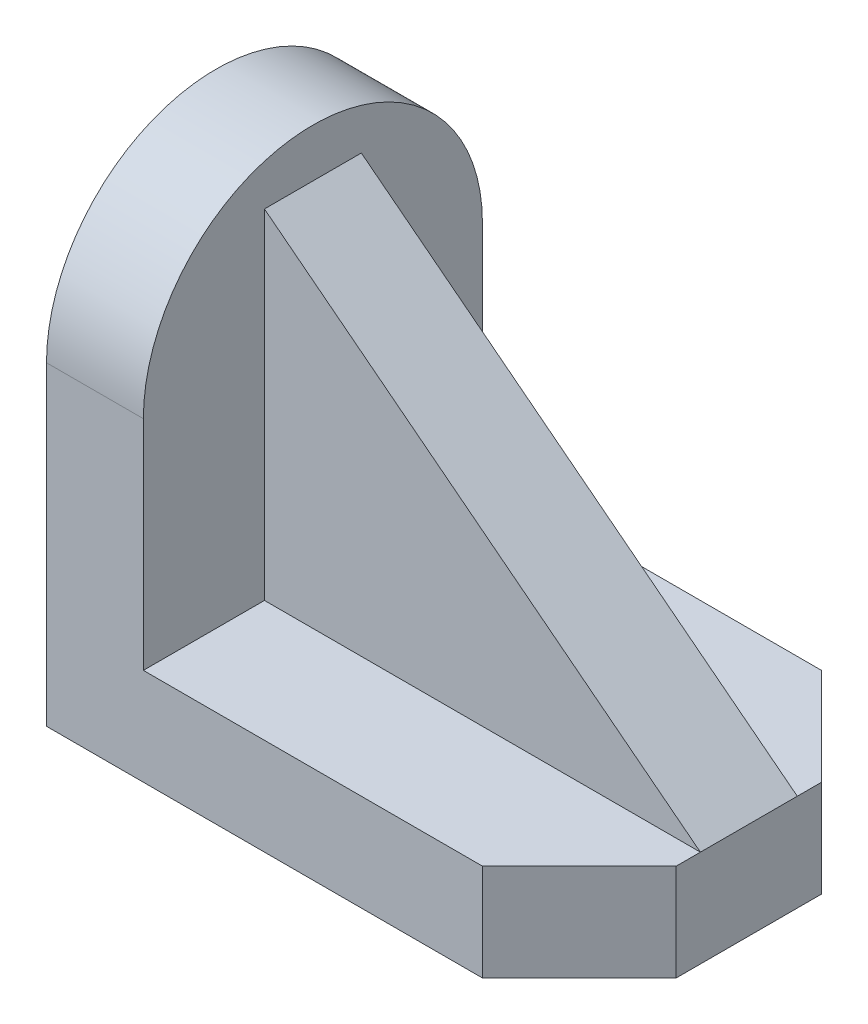
ISO-10303-21;
HEADER;
FILE_DESCRIPTION(('STEP AP214'),'2;1');
FILE_NAME('part.step','',(''),(''),'','','');
FILE_SCHEMA(('AUTOMOTIVE_DESIGN { 1 0 10303 214 1 1 1 1 }'));
ENDSEC;
DATA;
#1=APPLICATION_CONTEXT('core data for automotive mechanical design processes');
#2=APPLICATION_PROTOCOL_DEFINITION('international standard','automotive_design',2000,#1);
#3=PRODUCT_CONTEXT('',#1,'mechanical');
#4=PRODUCT('Part','Part','',(#3));
#5=PRODUCT_RELATED_PRODUCT_CATEGORY('part','',(#4));
#6=PRODUCT_DEFINITION_FORMATION('','',#4);
#7=PRODUCT_DEFINITION_CONTEXT('part definition',#1,'design');
#8=PRODUCT_DEFINITION('design','',#6,#7);
#9=PRODUCT_DEFINITION_SHAPE('','',#8);
#10=(LENGTH_UNIT() NAMED_UNIT(*) SI_UNIT(.MILLI.,.METRE.));
#11=(NAMED_UNIT(*) PLANE_ANGLE_UNIT() SI_UNIT($,.RADIAN.));
#12=(NAMED_UNIT(*) SI_UNIT($,.STERADIAN.) SOLID_ANGLE_UNIT());
#13=UNCERTAINTY_MEASURE_WITH_UNIT(LENGTH_MEASURE(1.E-05),#10,'distance_accuracy_value','');
#14=(GEOMETRIC_REPRESENTATION_CONTEXT(3) GLOBAL_UNCERTAINTY_ASSIGNED_CONTEXT((#13)) GLOBAL_UNIT_ASSIGNED_CONTEXT((#10,
#11,#12)) REPRESENTATION_CONTEXT('',''));
#15=CARTESIAN_POINT('',(0.,0.,0.));
#16=DIRECTION('',(0.,0.,1.));
#17=DIRECTION('',(1.,0.,0.));
#18=AXIS2_PLACEMENT_3D('',#15,#16,#17);
#19=CARTESIAN_POINT('',(0.,12.,0.));
#20=DIRECTION('',(0.,1.,0.));
#21=DIRECTION('',(0.,0.,1.));
#22=AXIS2_PLACEMENT_3D('',#19,#20,#21);
#23=PLANE('',#22);
#24=DIRECTION('',(0.,0.,-1.));
#25=VECTOR('',#24,1.);
#26=CARTESIAN_POINT('',(-21.,12.,0.));
#27=LINE('',#26,#25);
#28=CARTESIAN_POINT('',(-21.,12.,-6.));
#29=VERTEX_POINT('',#28);
#30=CARTESIAN_POINT('',(-21.,12.,-21.));
#31=VERTEX_POINT('',#30);
#32=EDGE_CURVE('E210',#29,#31,#27,.T.);
#33=ORIENTED_EDGE('',*,*,#32,.F.);
#34=DIRECTION('',(1.,0.,0.));
#35=VECTOR('',#34,1.);
#36=CARTESIAN_POINT('',(-21.,12.,-6.));
#37=LINE('',#36,#35);
#38=CARTESIAN_POINT('',(33.,12.,-6.));
#39=VERTEX_POINT('',#38);
#40=EDGE_CURVE('E51',#29,#39,#37,.T.);
#41=ORIENTED_EDGE('',*,*,#40,.T.);
#42=DIRECTION('',(0.,0.,-1.));
#43=VECTOR('',#42,1.);
#44=CARTESIAN_POINT('',(33.,12.,-21.));
#45=LINE('',#44,#43);
#46=CARTESIAN_POINT('',(33.,12.,-8.99999999999996));
#47=VERTEX_POINT('',#46);
#48=EDGE_CURVE('E147',#39,#47,#45,.T.);
#49=ORIENTED_EDGE('',*,*,#48,.T.);
#50=DIRECTION('',(0.707106781186546,0.,0.707106781186549));
#51=VECTOR('',#50,1.);
#52=CARTESIAN_POINT('',(21.,12.,-21.));
#53=LINE('',#52,#51);
#54=CARTESIAN_POINT('',(21.,12.,-21.));
#55=VERTEX_POINT('',#54);
#56=EDGE_CURVE('E190',#47,#55,#53,.F.);
#57=ORIENTED_EDGE('',*,*,#56,.T.);
#58=DIRECTION('',(-1.,0.,0.));
#59=VECTOR('',#58,1.);
#60=CARTESIAN_POINT('',(-33.,12.,-21.));
#61=LINE('',#60,#59);
#62=EDGE_CURVE('E153',#55,#31,#61,.T.);
#63=ORIENTED_EDGE('',*,*,#62,.T.);
#64=EDGE_LOOP('',(#33,#41,#49,#57,#63));
#65=FACE_BOUND('',#64,.T.);
#66=ADVANCED_FACE('F35',(#65),#23,.T.);
#67=CARTESIAN_POINT('',(-21.,39.,0.));
#68=DIRECTION('',(-1.,0.,0.));
#69=DIRECTION('',(0.,0.,1.));
#70=AXIS2_PLACEMENT_3D('',#67,#68,#69);
#71=CYLINDRICAL_SURFACE('',#70,21.);
#72=DIRECTION('',(1.,0.,0.));
#73=VECTOR('',#72,1.);
#74=CARTESIAN_POINT('',(-21.,39.,21.));
#75=LINE('',#74,#73);
#76=CARTESIAN_POINT('',(-21.,39.,21.));
#77=VERTEX_POINT('',#76);
#78=CARTESIAN_POINT('',(-33.,39.,21.));
#79=VERTEX_POINT('',#78);
#80=EDGE_CURVE('E195',#77,#79,#75,.F.);
#81=ORIENTED_EDGE('',*,*,#80,.F.);
#82=CARTESIAN_POINT('',(-21.,39.,0.));
#83=DIRECTION('',(1.,0.,0.));
#84=DIRECTION('',(0.,0.,-1.));
#85=AXIS2_PLACEMENT_3D('',#82,#83,#84);
#86=CIRCLE('',#85,21.);
#87=CARTESIAN_POINT('',(-21.,39.,-21.));
#88=VERTEX_POINT('',#87);
#89=EDGE_CURVE('E44',#88,#77,#86,.T.);
#90=ORIENTED_EDGE('',*,*,#89,.F.);
#91=DIRECTION('',(1.,0.,0.));
#92=VECTOR('',#91,1.);
#93=CARTESIAN_POINT('',(-21.,39.,-21.));
#94=LINE('',#93,#92);
#95=CARTESIAN_POINT('',(-33.,39.,-21.));
#96=VERTEX_POINT('',#95);
#97=EDGE_CURVE('E198',#96,#88,#94,.T.);
#98=ORIENTED_EDGE('',*,*,#97,.F.);
#99=CARTESIAN_POINT('',(-33.,39.,0.));
#100=DIRECTION('',(1.,0.,0.));
#101=DIRECTION('',(0.,0.,-1.));
#102=AXIS2_PLACEMENT_3D('',#99,#100,#101);
#103=CIRCLE('',#102,21.);
#104=EDGE_CURVE('E11',#79,#96,#103,.F.);
#105=ORIENTED_EDGE('',*,*,#104,.F.);
#106=EDGE_LOOP('',(#81,#90,#98,#105));
#107=FACE_BOUND('',#106,.T.);
#108=ADVANCED_FACE('F38',(#107),#71,.T.);
#109=CARTESIAN_POINT('',(33.,12.,-21.));
#110=DIRECTION('',(-1.,0.,0.));
#111=DIRECTION('',(0.,0.,1.));
#112=AXIS2_PLACEMENT_3D('',#109,#110,#111);
#113=PLANE('',#112);
#114=DIRECTION('',(0.,0.,-1.));
#115=VECTOR('',#114,1.);
#116=CARTESIAN_POINT('',(33.,0.,-21.));
#117=LINE('',#116,#115);
#118=CARTESIAN_POINT('',(33.,0.,8.99999999999999));
#119=VERTEX_POINT('',#118);
#120=CARTESIAN_POINT('',(33.,0.,-8.99999999999996));
#121=VERTEX_POINT('',#120);
#122=EDGE_CURVE('E165',#119,#121,#117,.T.);
#123=ORIENTED_EDGE('',*,*,#122,.T.);
#124=DIRECTION('',(0.,1.,0.));
#125=VECTOR('',#124,1.);
#126=CARTESIAN_POINT('',(33.,12.,-8.99999999999995));
#127=LINE('',#126,#125);
#128=EDGE_CURVE('E187',#121,#47,#127,.T.);
#129=ORIENTED_EDGE('',*,*,#128,.T.);
#130=ORIENTED_EDGE('',*,*,#48,.F.);
#131=DIRECTION('',(0.,0.,-1.));
#132=VECTOR('',#131,1.);
#133=CARTESIAN_POINT('',(33.,12.,6.));
#134=LINE('',#133,#132);
#135=CARTESIAN_POINT('',(33.,12.,6.));
#136=VERTEX_POINT('',#135);
#137=EDGE_CURVE('E123',#136,#39,#134,.T.);
#138=ORIENTED_EDGE('',*,*,#137,.F.);
#139=CARTESIAN_POINT('',(33.,12.,8.99999999999999));
#140=VERTEX_POINT('',#139);
#141=EDGE_CURVE('E144',#140,#136,#45,.T.);
#142=ORIENTED_EDGE('',*,*,#141,.F.);
#143=DIRECTION('',(0.,-1.,0.));
#144=VECTOR('',#143,1.);
#145=CARTESIAN_POINT('',(33.,12.,8.99999999999999));
#146=LINE('',#145,#144);
#147=EDGE_CURVE('E185',#140,#119,#146,.T.);
#148=ORIENTED_EDGE('',*,*,#147,.T.);
#149=EDGE_LOOP('',(#123,#129,#130,#138,#142,#148));
#150=FACE_BOUND('',#149,.T.);
#151=ADVANCED_FACE('F142',(#150),#113,.F.);
#152=CARTESIAN_POINT('',(-33.,12.,-21.));
#153=DIRECTION('',(0.,0.,1.));
#154=DIRECTION('',(1.,0.,0.));
#155=AXIS2_PLACEMENT_3D('',#152,#153,#154);
#156=PLANE('',#155);
#157=DIRECTION('',(0.,-1.,0.));
#158=VECTOR('',#157,1.);
#159=CARTESIAN_POINT('',(-33.,12.,-21.));
#160=LINE('',#159,#158);
#161=CARTESIAN_POINT('',(-33.,0.,-21.));
#162=VERTEX_POINT('',#161);
#163=EDGE_CURVE('E175',#96,#162,#160,.T.);
#164=ORIENTED_EDGE('',*,*,#163,.F.);
#165=ORIENTED_EDGE('',*,*,#97,.T.);
#166=DIRECTION('',(0.,-1.,0.));
#167=VECTOR('',#166,1.);
#168=CARTESIAN_POINT('',(-21.,0.,-21.));
#169=LINE('',#168,#167);
#170=EDGE_CURVE('E148',#88,#31,#169,.T.);
#171=ORIENTED_EDGE('',*,*,#170,.T.);
#172=ORIENTED_EDGE('',*,*,#62,.F.);
#173=DIRECTION('',(0.,-1.,0.));
#174=VECTOR('',#173,1.);
#175=CARTESIAN_POINT('',(21.,12.,-21.));
#176=LINE('',#175,#174);
#177=CARTESIAN_POINT('',(21.,0.,-21.));
#178=VERTEX_POINT('',#177);
#179=EDGE_CURVE('E177',#55,#178,#176,.T.);
#180=ORIENTED_EDGE('',*,*,#179,.T.);
#181=DIRECTION('',(-1.,0.,0.));
#182=VECTOR('',#181,1.);
#183=CARTESIAN_POINT('',(-33.,0.,-21.));
#184=LINE('',#183,#182);
#185=EDGE_CURVE('E167',#178,#162,#184,.T.);
#186=ORIENTED_EDGE('',*,*,#185,.T.);
#187=EDGE_LOOP('',(#164,#165,#171,#172,#180,#186));
#188=FACE_BOUND('',#187,.T.);
#189=ADVANCED_FACE('F223',(#188),#156,.F.);
#190=CARTESIAN_POINT('',(-33.,12.,-21.));
#191=DIRECTION('',(1.,0.,0.));
#192=DIRECTION('',(0.,0.,-1.));
#193=AXIS2_PLACEMENT_3D('',#190,#191,#192);
#194=PLANE('',#193);
#195=DIRECTION('',(0.,-1.,0.));
#196=VECTOR('',#195,1.);
#197=CARTESIAN_POINT('',(-33.,12.,21.));
#198=LINE('',#197,#196);
#199=CARTESIAN_POINT('',(-33.,0.,21.));
#200=VERTEX_POINT('',#199);
#201=EDGE_CURVE('E164',#79,#200,#198,.T.);
#202=ORIENTED_EDGE('',*,*,#201,.F.);
#203=ORIENTED_EDGE('',*,*,#104,.T.);
#204=ORIENTED_EDGE('',*,*,#163,.T.);
#205=DIRECTION('',(0.,0.,1.));
#206=VECTOR('',#205,1.);
#207=CARTESIAN_POINT('',(-33.,0.,-21.));
#208=LINE('',#207,#206);
#209=EDGE_CURVE('E170',#162,#200,#208,.T.);
#210=ORIENTED_EDGE('',*,*,#209,.T.);
#211=EDGE_LOOP('',(#202,#203,#204,#210));
#212=FACE_BOUND('',#211,.T.);
#213=ADVANCED_FACE('F228',(#212),#194,.F.);
#214=CARTESIAN_POINT('',(-33.,12.,21.));
#215=DIRECTION('',(0.,0.,-1.));
#216=DIRECTION('',(-1.,0.,0.));
#217=AXIS2_PLACEMENT_3D('',#214,#215,#216);
#218=PLANE('',#217);
#219=DIRECTION('',(0.,1.,0.));
#220=VECTOR('',#219,1.);
#221=CARTESIAN_POINT('',(-21.,0.,21.));
#222=LINE('',#221,#220);
#223=CARTESIAN_POINT('',(-21.,12.,21.));
#224=VERTEX_POINT('',#223);
#225=EDGE_CURVE('E204',#224,#77,#222,.T.);
#226=ORIENTED_EDGE('',*,*,#225,.T.);
#227=ORIENTED_EDGE('',*,*,#80,.T.);
#228=ORIENTED_EDGE('',*,*,#201,.T.);
#229=DIRECTION('',(1.,0.,0.));
#230=VECTOR('',#229,1.);
#231=CARTESIAN_POINT('',(-33.,0.,21.));
#232=LINE('',#231,#230);
#233=CARTESIAN_POINT('',(21.,0.,21.));
#234=VERTEX_POINT('',#233);
#235=EDGE_CURVE('E158',#200,#234,#232,.T.);
#236=ORIENTED_EDGE('',*,*,#235,.T.);
#237=DIRECTION('',(0.,1.,0.));
#238=VECTOR('',#237,1.);
#239=CARTESIAN_POINT('',(21.,12.,21.));
#240=LINE('',#239,#238);
#241=CARTESIAN_POINT('',(21.,12.,21.));
#242=VERTEX_POINT('',#241);
#243=EDGE_CURVE('E192',#234,#242,#240,.T.);
#244=ORIENTED_EDGE('',*,*,#243,.T.);
#245=DIRECTION('',(1.,0.,0.));
#246=VECTOR('',#245,1.);
#247=CARTESIAN_POINT('',(-33.,12.,21.));
#248=LINE('',#247,#246);
#249=EDGE_CURVE('E156',#224,#242,#248,.T.);
#250=ORIENTED_EDGE('',*,*,#249,.F.);
#251=EDGE_LOOP('',(#226,#227,#228,#236,#244,#250));
#252=FACE_BOUND('',#251,.T.);
#253=ADVANCED_FACE('F209',(#252),#218,.F.);
#254=DIRECTION('',(1.,0.,0.));
#255=VECTOR('',#254,1.);
#256=CARTESIAN_POINT('',(-21.,12.,6.));
#257=LINE('',#256,#255);
#258=CARTESIAN_POINT('',(-21.,12.,6.));
#259=VERTEX_POINT('',#258);
#260=EDGE_CURVE('E129',#259,#136,#257,.T.);
#261=ORIENTED_EDGE('',*,*,#260,.F.);
#262=EDGE_CURVE('E160',#224,#259,#27,.T.);
#263=ORIENTED_EDGE('',*,*,#262,.F.);
#264=ORIENTED_EDGE('',*,*,#249,.T.);
#265=DIRECTION('',(-0.707106781186549,0.,0.707106781186546));
#266=VECTOR('',#265,1.);
#267=CARTESIAN_POINT('',(20.9999999999999,12.,21.));
#268=LINE('',#267,#266);
#269=EDGE_CURVE('E152',#242,#140,#268,.F.);
#270=ORIENTED_EDGE('',*,*,#269,.T.);
#271=ORIENTED_EDGE('',*,*,#141,.T.);
#272=EDGE_LOOP('',(#261,#263,#264,#270,#271));
#273=FACE_BOUND('',#272,.T.);
#274=ADVANCED_FACE('F150',(#273),#23,.T.);
#275=CARTESIAN_POINT('',(0.,0.,0.));
#276=DIRECTION('',(0.,1.,0.));
#277=DIRECTION('',(0.,0.,1.));
#278=AXIS2_PLACEMENT_3D('',#275,#276,#277);
#279=PLANE('',#278);
#280=DIRECTION('',(0.707106781186549,0.,-0.707106781186546));
#281=VECTOR('',#280,1.);
#282=CARTESIAN_POINT('',(33.,0.,8.99999999999999));
#283=LINE('',#282,#281);
#284=EDGE_CURVE('E180',#119,#234,#283,.F.);
#285=ORIENTED_EDGE('',*,*,#284,.T.);
#286=ORIENTED_EDGE('',*,*,#235,.F.);
#287=ORIENTED_EDGE('',*,*,#209,.F.);
#288=ORIENTED_EDGE('',*,*,#185,.F.);
#289=DIRECTION('',(-0.707106781186546,0.,-0.707106781186549));
#290=VECTOR('',#289,1.);
#291=CARTESIAN_POINT('',(21.,0.,-21.));
#292=LINE('',#291,#290);
#293=EDGE_CURVE('E183',#178,#121,#292,.F.);
#294=ORIENTED_EDGE('',*,*,#293,.T.);
#295=ORIENTED_EDGE('',*,*,#122,.F.);
#296=EDGE_LOOP('',(#285,#286,#287,#288,#294,#295));
#297=FACE_BOUND('',#296,.T.);
#298=ADVANCED_FACE('F233',(#297),#279,.F.);
#299=CARTESIAN_POINT('',(21.,12.,-21.));
#300=DIRECTION('',(-0.707106781186549,0.,0.707106781186546));
#301=DIRECTION('',(0.,-1.,0.));
#302=AXIS2_PLACEMENT_3D('',#299,#300,#301);
#303=PLANE('',#302);
#304=ORIENTED_EDGE('',*,*,#56,.F.);
#305=ORIENTED_EDGE('',*,*,#128,.F.);
#306=ORIENTED_EDGE('',*,*,#293,.F.);
#307=ORIENTED_EDGE('',*,*,#179,.F.);
#308=EDGE_LOOP('',(#304,#305,#306,#307));
#309=FACE_BOUND('',#308,.T.);
#310=ADVANCED_FACE('F239',(#309),#303,.F.);
#311=CARTESIAN_POINT('',(33.,12.,8.99999999999999));
#312=DIRECTION('',(-0.707106781186546,0.,-0.707106781186549));
#313=DIRECTION('',(0.,-1.,0.));
#314=AXIS2_PLACEMENT_3D('',#311,#312,#313);
#315=PLANE('',#314);
#316=ORIENTED_EDGE('',*,*,#269,.F.);
#317=ORIENTED_EDGE('',*,*,#243,.F.);
#318=ORIENTED_EDGE('',*,*,#284,.F.);
#319=ORIENTED_EDGE('',*,*,#147,.F.);
#320=EDGE_LOOP('',(#316,#317,#318,#319));
#321=FACE_BOUND('',#320,.T.);
#322=ADVANCED_FACE('F235',(#321),#315,.F.);
#323=CARTESIAN_POINT('',(-21.,0.,0.));
#324=DIRECTION('',(1.,0.,0.));
#325=DIRECTION('',(0.,0.,-1.));
#326=AXIS2_PLACEMENT_3D('',#323,#324,#325);
#327=PLANE('',#326);
#328=DIRECTION('',(0.,-1.,0.));
#329=VECTOR('',#328,1.);
#330=CARTESIAN_POINT('',(-21.,12.,6.));
#331=LINE('',#330,#329);
#332=CARTESIAN_POINT('',(-21.,54.,6.));
#333=VERTEX_POINT('',#332);
#334=EDGE_CURVE('E128',#333,#259,#331,.T.);
#335=ORIENTED_EDGE('',*,*,#334,.F.);
#336=DIRECTION('',(0.,0.,-1.));
#337=VECTOR('',#336,1.);
#338=CARTESIAN_POINT('',(-21.,54.,6.));
#339=LINE('',#338,#337);
#340=CARTESIAN_POINT('',(-21.,54.,-6.));
#341=VERTEX_POINT('',#340);
#342=EDGE_CURVE('E125',#333,#341,#339,.T.);
#343=ORIENTED_EDGE('',*,*,#342,.T.);
#344=DIRECTION('',(0.,-1.,0.));
#345=VECTOR('',#344,1.);
#346=CARTESIAN_POINT('',(-21.,12.,-6.));
#347=LINE('',#346,#345);
#348=EDGE_CURVE('E136',#341,#29,#347,.T.);
#349=ORIENTED_EDGE('',*,*,#348,.T.);
#350=ORIENTED_EDGE('',*,*,#32,.T.);
#351=ORIENTED_EDGE('',*,*,#170,.F.);
#352=ORIENTED_EDGE('',*,*,#89,.T.);
#353=ORIENTED_EDGE('',*,*,#225,.F.);
#354=ORIENTED_EDGE('',*,*,#262,.T.);
#355=EDGE_LOOP('',(#335,#343,#349,#350,#351,#352,#353,#354));
#356=FACE_BOUND('',#355,.T.);
#357=ADVANCED_FACE('F202',(#356),#327,.T.);
#358=CARTESIAN_POINT('',(-21.,54.,6.));
#359=DIRECTION('',(-0.613940613514921,-0.789352217376326,0.));
#360=DIRECTION('',(0.789352217376326,-0.613940613514921,0.));
#361=AXIS2_PLACEMENT_3D('',#358,#359,#360);
#362=PLANE('',#361);
#363=DIRECTION('',(-0.789352217376326,0.61394061351492,0.));
#364=VECTOR('',#363,1.);
#365=CARTESIAN_POINT('',(-21.,54.,-6.));
#366=LINE('',#365,#364);
#367=EDGE_CURVE('E215',#39,#341,#366,.T.);
#368=ORIENTED_EDGE('',*,*,#367,.T.);
#369=ORIENTED_EDGE('',*,*,#342,.F.);
#370=DIRECTION('',(-0.789352217376326,0.61394061351492,0.));
#371=VECTOR('',#370,1.);
#372=CARTESIAN_POINT('',(-21.,54.,6.));
#373=LINE('',#372,#371);
#374=EDGE_CURVE('E119',#136,#333,#373,.T.);
#375=ORIENTED_EDGE('',*,*,#374,.F.);
#376=ORIENTED_EDGE('',*,*,#137,.T.);
#377=EDGE_LOOP('',(#368,#369,#375,#376));
#378=FACE_BOUND('',#377,.T.);
#379=ADVANCED_FACE('F121',(#378),#362,.F.);
#380=CARTESIAN_POINT('',(0.,0.,6.));
#381=DIRECTION('',(0.,0.,1.));
#382=DIRECTION('',(1.,0.,0.));
#383=AXIS2_PLACEMENT_3D('',#380,#381,#382);
#384=PLANE('',#383);
#385=ORIENTED_EDGE('',*,*,#260,.T.);
#386=ORIENTED_EDGE('',*,*,#374,.T.);
#387=ORIENTED_EDGE('',*,*,#334,.T.);
#388=EDGE_LOOP('',(#385,#386,#387));
#389=FACE_BOUND('',#388,.T.);
#390=ADVANCED_FACE('F132',(#389),#384,.T.);
#391=CARTESIAN_POINT('',(0.,0.,-6.));
#392=DIRECTION('',(0.,0.,1.));
#393=DIRECTION('',(1.,0.,0.));
#394=AXIS2_PLACEMENT_3D('',#391,#392,#393);
#395=PLANE('',#394);
#396=ORIENTED_EDGE('',*,*,#40,.F.);
#397=ORIENTED_EDGE('',*,*,#348,.F.);
#398=ORIENTED_EDGE('',*,*,#367,.F.);
#399=EDGE_LOOP('',(#396,#397,#398));
#400=FACE_BOUND('',#399,.T.);
#401=ADVANCED_FACE('F310',(#400),#395,.F.);
#402=CLOSED_SHELL('',(#66,#108,#151,#189,#213,#253,#274,#298,#310,#322,#357,#379,#390,#401));
#403=MANIFOLD_SOLID_BREP('B2',#402);
#404=ADVANCED_BREP_SHAPE_REPRESENTATION('',(#18,#403),#14);
#405=SHAPE_DEFINITION_REPRESENTATION(#9,#404);
ENDSEC;
END-ISO-10303-21;
